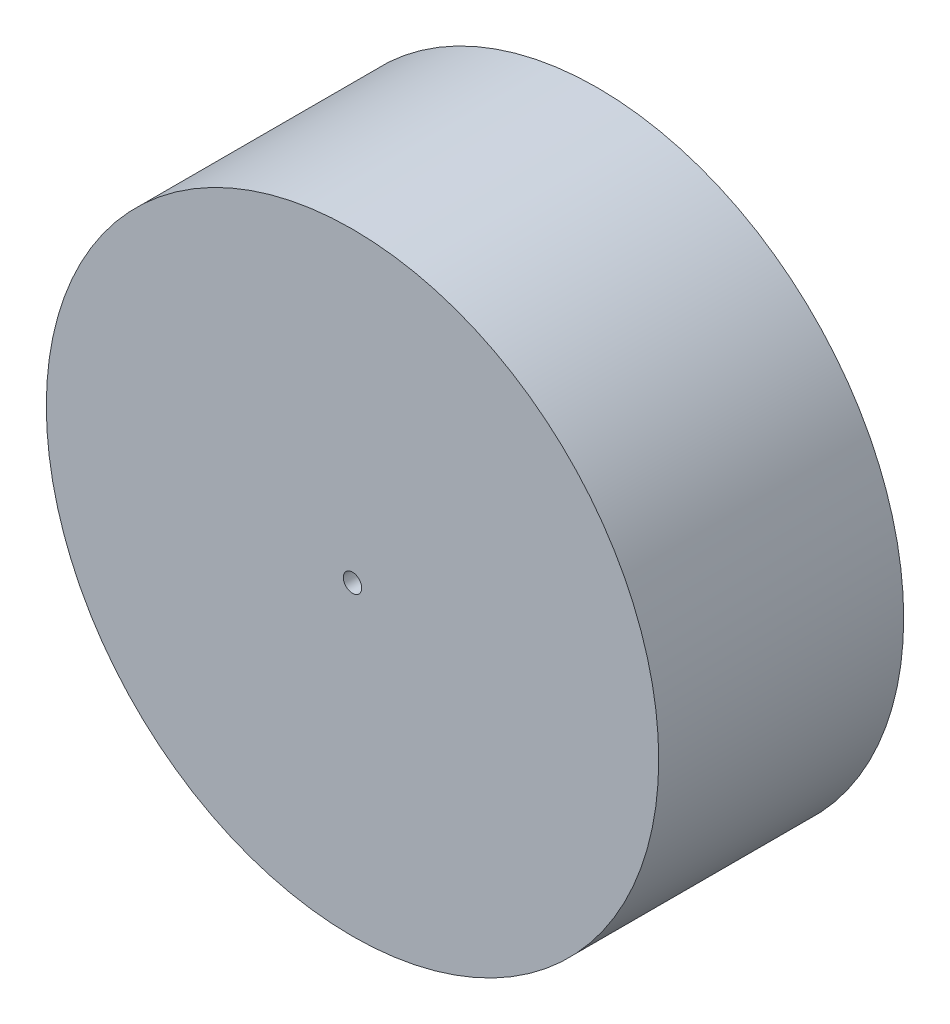
ISO-10303-21;
HEADER;
FILE_DESCRIPTION(('STEP AP214'),'2;1');
FILE_NAME('part.step','',(''),(''),'','','');
FILE_SCHEMA(('AUTOMOTIVE_DESIGN { 1 0 10303 214 1 1 1 1 }'));
ENDSEC;
DATA;
#1=APPLICATION_CONTEXT('core data for automotive mechanical design processes');
#2=APPLICATION_PROTOCOL_DEFINITION('international standard','automotive_design',2000,#1);
#3=PRODUCT_CONTEXT('',#1,'mechanical');
#4=PRODUCT('Part','Part','',(#3));
#5=PRODUCT_RELATED_PRODUCT_CATEGORY('part','',(#4));
#6=PRODUCT_DEFINITION_FORMATION('','',#4);
#7=PRODUCT_DEFINITION_CONTEXT('part definition',#1,'design');
#8=PRODUCT_DEFINITION('design','',#6,#7);
#9=PRODUCT_DEFINITION_SHAPE('','',#8);
#10=(LENGTH_UNIT() NAMED_UNIT(*) SI_UNIT(.MILLI.,.METRE.));
#11=(NAMED_UNIT(*) PLANE_ANGLE_UNIT() SI_UNIT($,.RADIAN.));
#12=(NAMED_UNIT(*) SI_UNIT($,.STERADIAN.) SOLID_ANGLE_UNIT());
#13=UNCERTAINTY_MEASURE_WITH_UNIT(LENGTH_MEASURE(1.E-05),#10,'distance_accuracy_value','');
#14=(GEOMETRIC_REPRESENTATION_CONTEXT(3) GLOBAL_UNCERTAINTY_ASSIGNED_CONTEXT((#13)) GLOBAL_UNIT_ASSIGNED_CONTEXT((#10,
#11,#12)) REPRESENTATION_CONTEXT('',''));
#15=CARTESIAN_POINT('',(0.,0.,0.));
#16=DIRECTION('',(0.,0.,1.));
#17=DIRECTION('',(1.,0.,0.));
#18=AXIS2_PLACEMENT_3D('',#15,#16,#17);
#19=CARTESIAN_POINT('',(0.,0.,40.));
#20=DIRECTION('',(0.,0.,-1.));
#21=DIRECTION('',(-1.,0.,0.));
#22=AXIS2_PLACEMENT_3D('',#19,#20,#21);
#23=CYLINDRICAL_SURFACE('',#22,50.);
#24=CARTESIAN_POINT('',(0.,0.,40.));
#25=DIRECTION('',(0.,0.,1.));
#26=DIRECTION('',(1.,0.,0.));
#27=AXIS2_PLACEMENT_3D('',#24,#25,#26);
#28=CIRCLE('',#27,50.);
#29=CARTESIAN_POINT('',(50.,0.,40.));
#30=VERTEX_POINT('',#29);
#31=EDGE_CURVE('E11',#30,#30,#28,.T.);
#32=ORIENTED_EDGE('',*,*,#31,.F.);
#33=EDGE_LOOP('',(#32));
#34=FACE_BOUND('',#33,.T.);
#35=CARTESIAN_POINT('',(0.,0.,0.));
#36=DIRECTION('',(0.,0.,1.));
#37=DIRECTION('',(1.,0.,0.));
#38=AXIS2_PLACEMENT_3D('',#35,#36,#37);
#39=CIRCLE('',#38,50.);
#40=CARTESIAN_POINT('',(50.,0.,0.));
#41=VERTEX_POINT('',#40);
#42=EDGE_CURVE('E40',#41,#41,#39,.T.);
#43=ORIENTED_EDGE('',*,*,#42,.T.);
#44=EDGE_LOOP('',(#43));
#45=FACE_BOUND('',#44,.T.);
#46=ADVANCED_FACE('F32',(#34,#45),#23,.T.);
#47=CARTESIAN_POINT('',(0.,0.,40.));
#48=DIRECTION('',(0.,0.,1.));
#49=DIRECTION('',(1.,0.,0.));
#50=AXIS2_PLACEMENT_3D('',#47,#48,#49);
#51=PLANE('',#50);
#52=CARTESIAN_POINT('',(0.,0.,40.));
#53=DIRECTION('',(0.,0.,1.));
#54=DIRECTION('',(1.,0.,0.));
#55=AXIS2_PLACEMENT_3D('',#52,#53,#54);
#56=CIRCLE('',#55,1.5);
#57=CARTESIAN_POINT('',(1.5,0.,40.));
#58=VERTEX_POINT('',#57);
#59=EDGE_CURVE('E235',#58,#58,#56,.T.);
#60=ORIENTED_EDGE('',*,*,#59,.F.);
#61=EDGE_LOOP('',(#60));
#62=FACE_BOUND('',#61,.T.);
#63=ORIENTED_EDGE('',*,*,#31,.T.);
#64=EDGE_LOOP('',(#63));
#65=FACE_BOUND('',#64,.T.);
#66=ADVANCED_FACE('F151',(#62,#65),#51,.T.);
#67=CARTESIAN_POINT('',(0.,0.,0.));
#68=DIRECTION('',(0.,0.,1.));
#69=DIRECTION('',(1.,0.,0.));
#70=AXIS2_PLACEMENT_3D('',#67,#68,#69);
#71=PLANE('',#70);
#72=CARTESIAN_POINT('',(0.,0.,0.));
#73=DIRECTION('',(0.,0.,-1.));
#74=DIRECTION('',(-1.,0.,0.));
#75=AXIS2_PLACEMENT_3D('',#72,#73,#74);
#76=CIRCLE('',#75,30.);
#77=CARTESIAN_POINT('',(-30.,0.,0.));
#78=VERTEX_POINT('',#77);
#79=EDGE_CURVE('E134',#78,#78,#76,.T.);
#80=ORIENTED_EDGE('',*,*,#79,.F.);
#81=EDGE_LOOP('',(#80));
#82=FACE_BOUND('',#81,.T.);
#83=ORIENTED_EDGE('',*,*,#42,.F.);
#84=EDGE_LOOP('',(#83));
#85=FACE_BOUND('',#84,.T.);
#86=ADVANCED_FACE('F148',(#82,#85),#71,.F.);
#87=CARTESIAN_POINT('',(0.,0.,25.));
#88=DIRECTION('',(0.,0.,-1.));
#89=DIRECTION('',(-1.,0.,0.));
#90=AXIS2_PLACEMENT_3D('',#87,#88,#89);
#91=CYLINDRICAL_SURFACE('',#90,30.);
#92=CARTESIAN_POINT('',(0.,0.,25.));
#93=DIRECTION('',(0.,0.,-1.));
#94=DIRECTION('',(-1.,0.,0.));
#95=AXIS2_PLACEMENT_3D('',#92,#93,#94);
#96=CIRCLE('',#95,30.);
#97=CARTESIAN_POINT('',(-30.,0.,25.));
#98=VERTEX_POINT('',#97);
#99=EDGE_CURVE('E140',#98,#98,#96,.T.);
#100=ORIENTED_EDGE('',*,*,#99,.F.);
#101=EDGE_LOOP('',(#100));
#102=FACE_BOUND('',#101,.T.);
#103=ORIENTED_EDGE('',*,*,#79,.T.);
#104=EDGE_LOOP('',(#103));
#105=FACE_BOUND('',#104,.T.);
#106=ADVANCED_FACE('F150',(#102,#105),#91,.F.);
#107=CARTESIAN_POINT('',(0.,0.,25.));
#108=DIRECTION('',(0.,0.,-1.));
#109=DIRECTION('',(-1.,0.,0.));
#110=AXIS2_PLACEMENT_3D('',#107,#108,#109);
#111=PLANE('',#110);
#112=DIRECTION('',(-0.974839883963126,0.222906259747811,0.));
#113=VECTOR('',#112,1.);
#114=CARTESIAN_POINT('',(1.76626475026431,-5.73413540404948,25.));
#115=LINE('',#114,#113);
#116=CARTESIAN_POINT('',(1.76626475026431,-5.73413540404948,25.));
#117=VERTEX_POINT('',#116);
#118=CARTESIAN_POINT('',(-4.08277455351444,-4.39669784556262,25.));
#119=VERTEX_POINT('',#118);
#120=EDGE_CURVE('E120',#117,#119,#115,.T.);
#121=ORIENTED_EDGE('',*,*,#120,.F.);
#122=DIRECTION('',(-0.68046242558574,-0.732782974260436,0.));
#123=VECTOR('',#122,1.);
#124=CARTESIAN_POINT('',(5.84903930377875,-1.33743755848686,25.));
#125=LINE('',#124,#123);
#126=CARTESIAN_POINT('',(5.84903930377875,-1.33743755848686,25.));
#127=VERTEX_POINT('',#126);
#128=EDGE_CURVE('E130',#127,#117,#125,.T.);
#129=ORIENTED_EDGE('',*,*,#128,.F.);
#130=DIRECTION('',(0.294377458377386,-0.955689234008247,0.));
#131=VECTOR('',#130,1.);
#132=CARTESIAN_POINT('',(4.08277455351444,4.39669784556262,25.));
#133=LINE('',#132,#131);
#134=CARTESIAN_POINT('',(4.08277455351444,4.39669784556262,25.));
#135=VERTEX_POINT('',#134);
#136=EDGE_CURVE('E48',#135,#127,#133,.T.);
#137=ORIENTED_EDGE('',*,*,#136,.F.);
#138=DIRECTION('',(0.974839883963126,-0.222906259747811,0.));
#139=VECTOR('',#138,1.);
#140=CARTESIAN_POINT('',(-1.76626475026432,5.73413540404948,25.));
#141=LINE('',#140,#139);
#142=CARTESIAN_POINT('',(-1.76626475026432,5.73413540404948,25.));
#143=VERTEX_POINT('',#142);
#144=EDGE_CURVE('E98',#143,#135,#141,.T.);
#145=ORIENTED_EDGE('',*,*,#144,.F.);
#146=DIRECTION('',(0.68046242558574,0.732782974260436,0.));
#147=VECTOR('',#146,1.);
#148=CARTESIAN_POINT('',(-5.84903930377876,1.33743755848687,25.));
#149=LINE('',#148,#147);
#150=CARTESIAN_POINT('',(-5.84903930377876,1.33743755848687,25.));
#151=VERTEX_POINT('',#150);
#152=EDGE_CURVE('E125',#151,#143,#149,.T.);
#153=ORIENTED_EDGE('',*,*,#152,.F.);
#154=DIRECTION('',(-0.294377458377386,0.955689234008247,0.));
#155=VECTOR('',#154,1.);
#156=CARTESIAN_POINT('',(-4.08277455351444,-4.39669784556262,25.));
#157=LINE('',#156,#155);
#158=EDGE_CURVE('E122',#119,#151,#157,.T.);
#159=ORIENTED_EDGE('',*,*,#158,.F.);
#160=EDGE_LOOP('',(#121,#129,#137,#145,#153,#159));
#161=FACE_BOUND('',#160,.T.);
#162=ORIENTED_EDGE('',*,*,#99,.T.);
#163=EDGE_LOOP('',(#162));
#164=FACE_BOUND('',#163,.T.);
#165=ADVANCED_FACE('F157',(#161,#164),#111,.T.);
#166=CARTESIAN_POINT('',(1.76626475026431,-5.73413540404948,30.));
#167=DIRECTION('',(-0.222906259747811,-0.974839883963126,0.));
#168=DIRECTION('',(0.974839883963126,-0.222906259747811,0.));
#169=AXIS2_PLACEMENT_3D('',#166,#167,#168);
#170=PLANE('',#169);
#171=ORIENTED_EDGE('',*,*,#120,.T.);
#172=DIRECTION('',(0.,0.,-1.));
#173=VECTOR('',#172,1.);
#174=CARTESIAN_POINT('',(-4.08277455351444,-4.39669784556262,30.));
#175=LINE('',#174,#173);
#176=CARTESIAN_POINT('',(-4.08277455351444,-4.39669784556262,30.));
#177=VERTEX_POINT('',#176);
#178=EDGE_CURVE('E80',#177,#119,#175,.T.);
#179=ORIENTED_EDGE('',*,*,#178,.F.);
#180=DIRECTION('',(-0.974839883963126,0.222906259747811,0.));
#181=VECTOR('',#180,1.);
#182=CARTESIAN_POINT('',(1.76626475026431,-5.73413540404948,30.));
#183=LINE('',#182,#181);
#184=CARTESIAN_POINT('',(1.76626475026431,-5.73413540404948,30.));
#185=VERTEX_POINT('',#184);
#186=EDGE_CURVE('E132',#185,#177,#183,.T.);
#187=ORIENTED_EDGE('',*,*,#186,.F.);
#188=DIRECTION('',(0.,0.,-1.));
#189=VECTOR('',#188,1.);
#190=CARTESIAN_POINT('',(1.76626475026431,-5.73413540404948,30.));
#191=LINE('',#190,#189);
#192=EDGE_CURVE('E57',#185,#117,#191,.T.);
#193=ORIENTED_EDGE('',*,*,#192,.T.);
#194=EDGE_LOOP('',(#171,#179,#187,#193));
#195=FACE_BOUND('',#194,.T.);
#196=ADVANCED_FACE('F209',(#195),#170,.F.);
#197=CARTESIAN_POINT('',(5.84903930377875,-1.33743755848686,30.));
#198=DIRECTION('',(0.732782974260436,-0.68046242558574,0.));
#199=DIRECTION('',(0.68046242558574,0.732782974260436,0.));
#200=AXIS2_PLACEMENT_3D('',#197,#198,#199);
#201=PLANE('',#200);
#202=ORIENTED_EDGE('',*,*,#128,.T.);
#203=ORIENTED_EDGE('',*,*,#192,.F.);
#204=DIRECTION('',(-0.68046242558574,-0.732782974260436,0.));
#205=VECTOR('',#204,1.);
#206=CARTESIAN_POINT('',(5.84903930377875,-1.33743755848686,30.));
#207=LINE('',#206,#205);
#208=CARTESIAN_POINT('',(5.84903930377875,-1.33743755848686,30.));
#209=VERTEX_POINT('',#208);
#210=EDGE_CURVE('E107',#209,#185,#207,.T.);
#211=ORIENTED_EDGE('',*,*,#210,.F.);
#212=DIRECTION('',(0.,0.,-1.));
#213=VECTOR('',#212,1.);
#214=CARTESIAN_POINT('',(5.84903930377875,-1.33743755848686,30.));
#215=LINE('',#214,#213);
#216=EDGE_CURVE('E99',#209,#127,#215,.T.);
#217=ORIENTED_EDGE('',*,*,#216,.T.);
#218=EDGE_LOOP('',(#202,#203,#211,#217));
#219=FACE_BOUND('',#218,.T.);
#220=ADVANCED_FACE('F206',(#219),#201,.F.);
#221=CARTESIAN_POINT('',(4.08277455351444,4.39669784556262,30.));
#222=DIRECTION('',(0.955689234008247,0.294377458377386,0.));
#223=DIRECTION('',(-0.294377458377386,0.955689234008247,0.));
#224=AXIS2_PLACEMENT_3D('',#221,#222,#223);
#225=PLANE('',#224);
#226=ORIENTED_EDGE('',*,*,#136,.T.);
#227=ORIENTED_EDGE('',*,*,#216,.F.);
#228=DIRECTION('',(0.294377458377386,-0.955689234008247,0.));
#229=VECTOR('',#228,1.);
#230=CARTESIAN_POINT('',(4.08277455351444,4.39669784556262,30.));
#231=LINE('',#230,#229);
#232=CARTESIAN_POINT('',(4.08277455351444,4.39669784556262,30.));
#233=VERTEX_POINT('',#232);
#234=EDGE_CURVE('E103',#233,#209,#231,.T.);
#235=ORIENTED_EDGE('',*,*,#234,.F.);
#236=DIRECTION('',(0.,0.,-1.));
#237=VECTOR('',#236,1.);
#238=CARTESIAN_POINT('',(4.08277455351444,4.39669784556262,30.));
#239=LINE('',#238,#237);
#240=EDGE_CURVE('E91',#233,#135,#239,.T.);
#241=ORIENTED_EDGE('',*,*,#240,.T.);
#242=EDGE_LOOP('',(#226,#227,#235,#241));
#243=FACE_BOUND('',#242,.T.);
#244=ADVANCED_FACE('F104',(#243),#225,.F.);
#245=CARTESIAN_POINT('',(-1.76626475026432,5.73413540404948,30.));
#246=DIRECTION('',(0.222906259747811,0.974839883963126,0.));
#247=DIRECTION('',(-0.974839883963126,0.222906259747811,0.));
#248=AXIS2_PLACEMENT_3D('',#245,#246,#247);
#249=PLANE('',#248);
#250=ORIENTED_EDGE('',*,*,#144,.T.);
#251=ORIENTED_EDGE('',*,*,#240,.F.);
#252=DIRECTION('',(0.974839883963126,-0.222906259747811,0.));
#253=VECTOR('',#252,1.);
#254=CARTESIAN_POINT('',(-1.76626475026432,5.73413540404948,30.));
#255=LINE('',#254,#253);
#256=CARTESIAN_POINT('',(-1.76626475026432,5.73413540404948,30.));
#257=VERTEX_POINT('',#256);
#258=EDGE_CURVE('E95',#257,#233,#255,.T.);
#259=ORIENTED_EDGE('',*,*,#258,.F.);
#260=DIRECTION('',(0.,0.,-1.));
#261=VECTOR('',#260,1.);
#262=CARTESIAN_POINT('',(-1.76626475026432,5.73413540404948,30.));
#263=LINE('',#262,#261);
#264=EDGE_CURVE('E100',#257,#143,#263,.T.);
#265=ORIENTED_EDGE('',*,*,#264,.T.);
#266=EDGE_LOOP('',(#250,#251,#259,#265));
#267=FACE_BOUND('',#266,.T.);
#268=ADVANCED_FACE('F93',(#267),#249,.F.);
#269=CARTESIAN_POINT('',(-5.84903930377876,1.33743755848687,30.));
#270=DIRECTION('',(-0.732782974260436,0.68046242558574,0.));
#271=DIRECTION('',(-0.68046242558574,-0.732782974260436,0.));
#272=AXIS2_PLACEMENT_3D('',#269,#270,#271);
#273=PLANE('',#272);
#274=ORIENTED_EDGE('',*,*,#152,.T.);
#275=ORIENTED_EDGE('',*,*,#264,.F.);
#276=DIRECTION('',(0.68046242558574,0.732782974260436,0.));
#277=VECTOR('',#276,1.);
#278=CARTESIAN_POINT('',(-5.84903930377876,1.33743755848687,30.));
#279=LINE('',#278,#277);
#280=CARTESIAN_POINT('',(-5.84903930377876,1.33743755848687,30.));
#281=VERTEX_POINT('',#280);
#282=EDGE_CURVE('E113',#281,#257,#279,.T.);
#283=ORIENTED_EDGE('',*,*,#282,.F.);
#284=DIRECTION('',(0.,0.,-1.));
#285=VECTOR('',#284,1.);
#286=CARTESIAN_POINT('',(-5.84903930377876,1.33743755848687,30.));
#287=LINE('',#286,#285);
#288=EDGE_CURVE('E137',#281,#151,#287,.T.);
#289=ORIENTED_EDGE('',*,*,#288,.T.);
#290=EDGE_LOOP('',(#274,#275,#283,#289));
#291=FACE_BOUND('',#290,.T.);
#292=ADVANCED_FACE('F214',(#291),#273,.F.);
#293=CARTESIAN_POINT('',(-4.08277455351444,-4.39669784556262,30.));
#294=DIRECTION('',(-0.955689234008247,-0.294377458377386,0.));
#295=DIRECTION('',(0.294377458377386,-0.955689234008247,0.));
#296=AXIS2_PLACEMENT_3D('',#293,#294,#295);
#297=PLANE('',#296);
#298=ORIENTED_EDGE('',*,*,#158,.T.);
#299=ORIENTED_EDGE('',*,*,#288,.F.);
#300=DIRECTION('',(-0.294377458377386,0.955689234008247,0.));
#301=VECTOR('',#300,1.);
#302=CARTESIAN_POINT('',(-4.08277455351444,-4.39669784556262,30.));
#303=LINE('',#302,#301);
#304=EDGE_CURVE('E115',#177,#281,#303,.T.);
#305=ORIENTED_EDGE('',*,*,#304,.F.);
#306=ORIENTED_EDGE('',*,*,#178,.T.);
#307=EDGE_LOOP('',(#298,#299,#305,#306));
#308=FACE_BOUND('',#307,.T.);
#309=ADVANCED_FACE('F180',(#308),#297,.F.);
#310=CARTESIAN_POINT('',(0.,0.,30.));
#311=DIRECTION('',(0.,0.,-1.));
#312=DIRECTION('',(-1.,0.,0.));
#313=AXIS2_PLACEMENT_3D('',#310,#311,#312);
#314=PLANE('',#313);
#315=CARTESIAN_POINT('',(0.,0.,30.));
#316=DIRECTION('',(0.,0.,-1.));
#317=DIRECTION('',(-1.,0.,0.));
#318=AXIS2_PLACEMENT_3D('',#315,#316,#317);
#319=CIRCLE('',#318,1.5);
#320=CARTESIAN_POINT('',(-1.5,0.,30.));
#321=VERTEX_POINT('',#320);
#322=EDGE_CURVE('E35',#321,#321,#319,.T.);
#323=ORIENTED_EDGE('',*,*,#322,.F.);
#324=EDGE_LOOP('',(#323));
#325=FACE_BOUND('',#324,.T.);
#326=ORIENTED_EDGE('',*,*,#186,.T.);
#327=ORIENTED_EDGE('',*,*,#304,.T.);
#328=ORIENTED_EDGE('',*,*,#282,.T.);
#329=ORIENTED_EDGE('',*,*,#258,.T.);
#330=ORIENTED_EDGE('',*,*,#234,.T.);
#331=ORIENTED_EDGE('',*,*,#210,.T.);
#332=EDGE_LOOP('',(#326,#327,#328,#329,#330,#331));
#333=FACE_BOUND('',#332,.T.);
#334=ADVANCED_FACE('F110',(#325,#333),#314,.T.);
#335=CARTESIAN_POINT('',(0.,0.,0.));
#336=DIRECTION('',(0.,0.,1.));
#337=DIRECTION('',(1.,0.,0.));
#338=AXIS2_PLACEMENT_3D('',#335,#336,#337);
#339=CYLINDRICAL_SURFACE('',#338,1.5);
#340=ORIENTED_EDGE('',*,*,#322,.T.);
#341=EDGE_LOOP('',(#340));
#342=FACE_BOUND('',#341,.T.);
#343=ORIENTED_EDGE('',*,*,#59,.T.);
#344=EDGE_LOOP('',(#343));
#345=FACE_BOUND('',#344,.T.);
#346=ADVANCED_FACE('F189',(#342,#345),#339,.F.);
#347=CLOSED_SHELL('',(#46,#66,#86,#106,#165,#196,#220,#244,#268,#292,#309,#334,#346));
#348=MANIFOLD_SOLID_BREP('B2',#347);
#349=ADVANCED_BREP_SHAPE_REPRESENTATION('',(#18,#348),#14);
#350=SHAPE_DEFINITION_REPRESENTATION(#9,#349);
ENDSEC;
END-ISO-10303-21;
